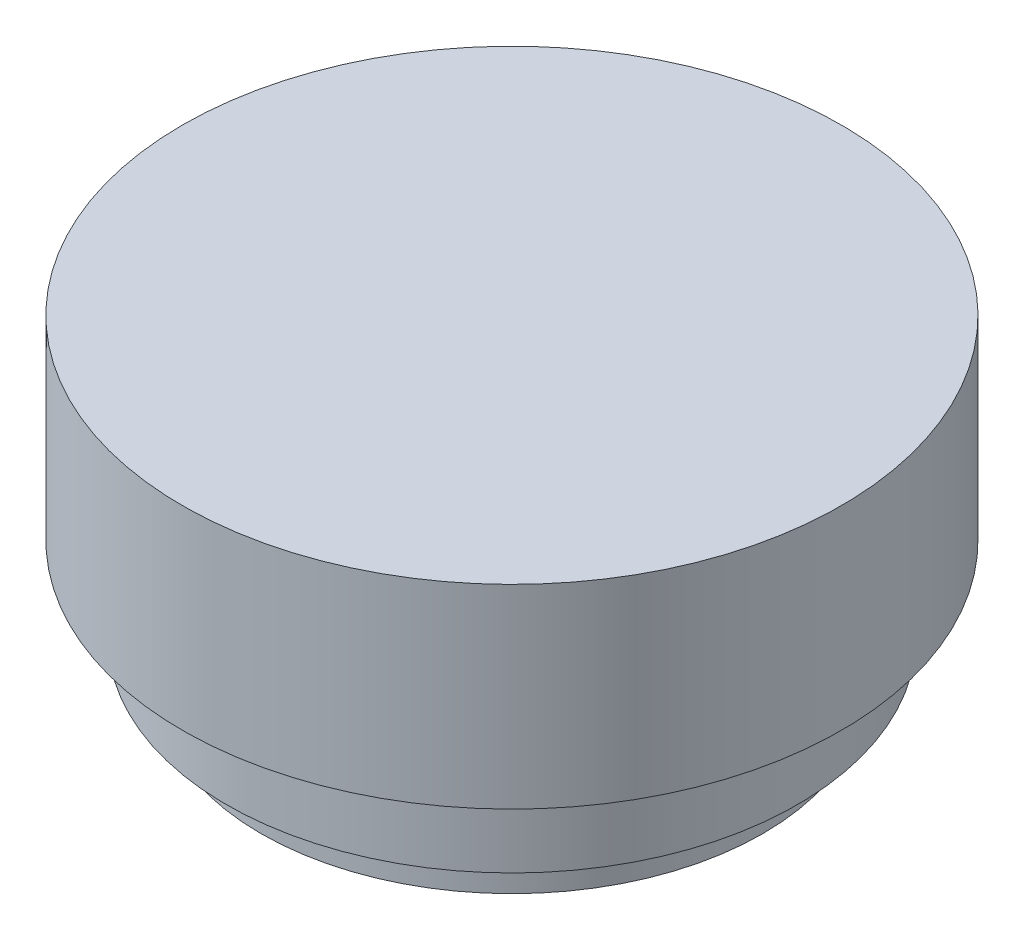
ISO-10303-21;
HEADER;
FILE_DESCRIPTION(('STEP AP214'),'2;1');
FILE_NAME('part.step','',(''),(''),'','','');
FILE_SCHEMA(('AUTOMOTIVE_DESIGN { 1 0 10303 214 1 1 1 1 }'));
ENDSEC;
DATA;
#1=APPLICATION_CONTEXT('core data for automotive mechanical design processes');
#2=APPLICATION_PROTOCOL_DEFINITION('international standard','automotive_design',2000,#1);
#3=PRODUCT_CONTEXT('',#1,'mechanical');
#4=PRODUCT('Part','Part','',(#3));
#5=PRODUCT_RELATED_PRODUCT_CATEGORY('part','',(#4));
#6=PRODUCT_DEFINITION_FORMATION('','',#4);
#7=PRODUCT_DEFINITION_CONTEXT('part definition',#1,'design');
#8=PRODUCT_DEFINITION('design','',#6,#7);
#9=PRODUCT_DEFINITION_SHAPE('','',#8);
#10=(LENGTH_UNIT() NAMED_UNIT(*) SI_UNIT(.MILLI.,.METRE.));
#11=(NAMED_UNIT(*) PLANE_ANGLE_UNIT() SI_UNIT($,.RADIAN.));
#12=(NAMED_UNIT(*) SI_UNIT($,.STERADIAN.) SOLID_ANGLE_UNIT());
#13=UNCERTAINTY_MEASURE_WITH_UNIT(LENGTH_MEASURE(1.E-05),#10,'distance_accuracy_value','');
#14=(GEOMETRIC_REPRESENTATION_CONTEXT(3) GLOBAL_UNCERTAINTY_ASSIGNED_CONTEXT((#13)) GLOBAL_UNIT_ASSIGNED_CONTEXT((#10,
#11,#12)) REPRESENTATION_CONTEXT('',''));
#15=CARTESIAN_POINT('',(0.,0.,0.));
#16=DIRECTION('',(0.,0.,1.));
#17=DIRECTION('',(1.,0.,0.));
#18=AXIS2_PLACEMENT_3D('',#15,#16,#17);
#19=CARTESIAN_POINT('',(0.,6.6,0.));
#20=DIRECTION('',(0.,-1.,0.));
#21=DIRECTION('',(1.,0.,0.));
#22=AXIS2_PLACEMENT_3D('',#19,#20,#21);
#23=PLANE('',#22);
#24=CARTESIAN_POINT('',(0.,6.6,0.));
#25=DIRECTION('',(0.,1.,0.));
#26=DIRECTION('',(-1.,0.,0.));
#27=AXIS2_PLACEMENT_3D('',#24,#25,#26);
#28=CIRCLE('',#27,29.);
#29=CARTESIAN_POINT('',(-29.,6.6,0.));
#30=VERTEX_POINT('',#29);
#31=EDGE_CURVE('E10',#30,#30,#28,.T.);
#32=ORIENTED_EDGE('',*,*,#31,.F.);
#33=EDGE_LOOP('',(#32));
#34=FACE_BOUND('',#33,.T.);
#35=ADVANCED_FACE('F38',(#34),#23,.T.);
#36=CARTESIAN_POINT('',(0.,44.,0.));
#37=DIRECTION('',(0.,1.,0.));
#38=DIRECTION('',(-1.,0.,0.));
#39=AXIS2_PLACEMENT_3D('',#36,#37,#38);
#40=CYLINDRICAL_SURFACE('',#39,29.);
#41=ORIENTED_EDGE('',*,*,#31,.T.);
#42=EDGE_LOOP('',(#41));
#43=FACE_BOUND('',#42,.T.);
#44=CARTESIAN_POINT('',(0.,11.5,0.));
#45=DIRECTION('',(0.,1.,0.));
#46=DIRECTION('',(-1.,0.,0.));
#47=AXIS2_PLACEMENT_3D('',#44,#45,#46);
#48=CIRCLE('',#47,29.);
#49=CARTESIAN_POINT('',(-29.,11.5,0.));
#50=VERTEX_POINT('',#49);
#51=EDGE_CURVE('E45',#50,#50,#48,.T.);
#52=ORIENTED_EDGE('',*,*,#51,.F.);
#53=EDGE_LOOP('',(#52));
#54=FACE_BOUND('',#53,.T.);
#55=ADVANCED_FACE('F86',(#43,#54),#40,.T.);
#56=CARTESIAN_POINT('',(-29.,11.5,0.));
#57=DIRECTION('',(0.,-1.,0.));
#58=DIRECTION('',(1.,0.,0.));
#59=AXIS2_PLACEMENT_3D('',#56,#57,#58);
#60=PLANE('',#59);
#61=ORIENTED_EDGE('',*,*,#51,.T.);
#62=EDGE_LOOP('',(#61));
#63=FACE_BOUND('',#62,.T.);
#64=CARTESIAN_POINT('',(0.,11.5,0.));
#65=DIRECTION('',(0.,1.,0.));
#66=DIRECTION('',(-1.,0.,0.));
#67=AXIS2_PLACEMENT_3D('',#64,#65,#66);
#68=CIRCLE('',#67,33.);
#69=CARTESIAN_POINT('',(-33.,11.5,0.));
#70=VERTEX_POINT('',#69);
#71=EDGE_CURVE('E50',#70,#70,#68,.T.);
#72=ORIENTED_EDGE('',*,*,#71,.F.);
#73=EDGE_LOOP('',(#72));
#74=FACE_BOUND('',#73,.T.);
#75=ADVANCED_FACE('F91',(#63,#74),#60,.T.);
#76=CARTESIAN_POINT('',(0.,44.,0.));
#77=DIRECTION('',(0.,1.,0.));
#78=DIRECTION('',(-1.,0.,0.));
#79=AXIS2_PLACEMENT_3D('',#76,#77,#78);
#80=CYLINDRICAL_SURFACE('',#79,33.);
#81=ORIENTED_EDGE('',*,*,#71,.T.);
#82=EDGE_LOOP('',(#81));
#83=FACE_BOUND('',#82,.T.);
#84=CARTESIAN_POINT('',(0.,21.5,0.));
#85=DIRECTION('',(0.,1.,0.));
#86=DIRECTION('',(-1.,0.,0.));
#87=AXIS2_PLACEMENT_3D('',#84,#85,#86);
#88=CIRCLE('',#87,33.);
#89=CARTESIAN_POINT('',(-33.,21.5,0.));
#90=VERTEX_POINT('',#89);
#91=EDGE_CURVE('E55',#90,#90,#88,.T.);
#92=ORIENTED_EDGE('',*,*,#91,.F.);
#93=EDGE_LOOP('',(#92));
#94=FACE_BOUND('',#93,.T.);
#95=ADVANCED_FACE('F82',(#83,#94),#80,.T.);
#96=CARTESIAN_POINT('',(-33.,21.5,0.));
#97=DIRECTION('',(0.,-1.,0.));
#98=DIRECTION('',(1.,0.,0.));
#99=AXIS2_PLACEMENT_3D('',#96,#97,#98);
#100=PLANE('',#99);
#101=ORIENTED_EDGE('',*,*,#91,.T.);
#102=EDGE_LOOP('',(#101));
#103=FACE_BOUND('',#102,.T.);
#104=CARTESIAN_POINT('',(0.,21.5,0.));
#105=DIRECTION('',(0.,1.,0.));
#106=DIRECTION('',(-1.,0.,0.));
#107=AXIS2_PLACEMENT_3D('',#104,#105,#106);
#108=CIRCLE('',#107,38.1);
#109=CARTESIAN_POINT('',(-38.1,21.5,0.));
#110=VERTEX_POINT('',#109);
#111=EDGE_CURVE('E61',#110,#110,#108,.T.);
#112=ORIENTED_EDGE('',*,*,#111,.F.);
#113=EDGE_LOOP('',(#112));
#114=FACE_BOUND('',#113,.T.);
#115=ADVANCED_FACE('F74',(#103,#114),#100,.T.);
#116=CARTESIAN_POINT('',(0.,44.,0.));
#117=DIRECTION('',(0.,1.,0.));
#118=DIRECTION('',(-1.,0.,0.));
#119=AXIS2_PLACEMENT_3D('',#116,#117,#118);
#120=CYLINDRICAL_SURFACE('',#119,38.1);
#121=ORIENTED_EDGE('',*,*,#111,.T.);
#122=EDGE_LOOP('',(#121));
#123=FACE_BOUND('',#122,.T.);
#124=CARTESIAN_POINT('',(0.,44.,0.));
#125=DIRECTION('',(0.,1.,0.));
#126=DIRECTION('',(-1.,0.,0.));
#127=AXIS2_PLACEMENT_3D('',#124,#125,#126);
#128=CIRCLE('',#127,38.1);
#129=CARTESIAN_POINT('',(-38.1,44.,0.));
#130=VERTEX_POINT('',#129);
#131=EDGE_CURVE('E65',#130,#130,#128,.T.);
#132=ORIENTED_EDGE('',*,*,#131,.F.);
#133=EDGE_LOOP('',(#132));
#134=FACE_BOUND('',#133,.T.);
#135=ADVANCED_FACE('F72',(#123,#134),#120,.T.);
#136=CARTESIAN_POINT('',(-38.1,44.,0.));
#137=DIRECTION('',(0.,1.,0.));
#138=DIRECTION('',(-1.,0.,0.));
#139=AXIS2_PLACEMENT_3D('',#136,#137,#138);
#140=PLANE('',#139);
#141=ORIENTED_EDGE('',*,*,#131,.T.);
#142=EDGE_LOOP('',(#141));
#143=FACE_BOUND('',#142,.T.);
#144=ADVANCED_FACE('F70',(#143),#140,.T.);
#145=CLOSED_SHELL('',(#35,#55,#75,#95,#115,#135,#144));
#146=MANIFOLD_SOLID_BREP('B2',#145);
#147=ADVANCED_BREP_SHAPE_REPRESENTATION('',(#18,#146),#14);
#148=SHAPE_DEFINITION_REPRESENTATION(#9,#147);
ENDSEC;
END-ISO-10303-21;
